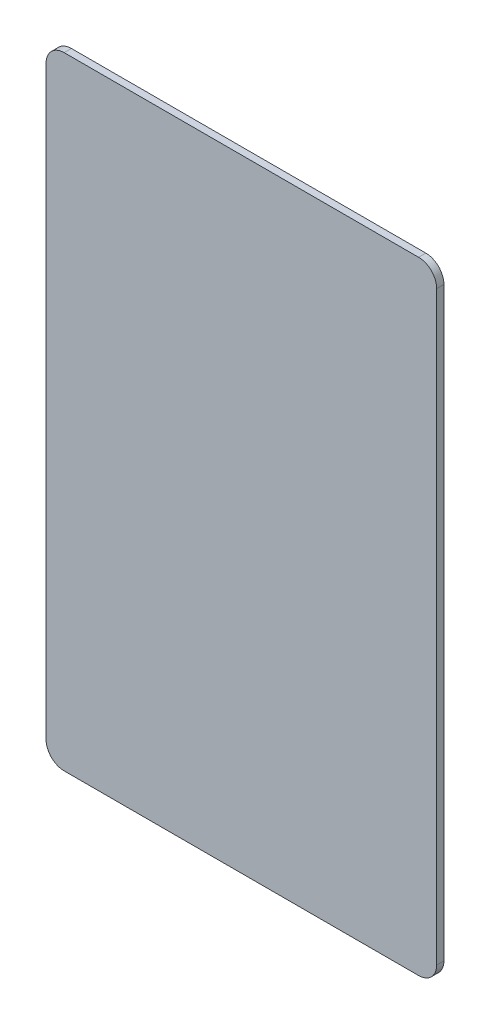
ISO-10303-21;
HEADER;
FILE_DESCRIPTION(('STEP AP214'),'2;1');
FILE_NAME('part.step','',(''),(''),'','','');
FILE_SCHEMA(('AUTOMOTIVE_DESIGN { 1 0 10303 214 1 1 1 1 }'));
ENDSEC;
DATA;
#1=APPLICATION_CONTEXT('core data for automotive mechanical design processes');
#2=APPLICATION_PROTOCOL_DEFINITION('international standard','automotive_design',2000,#1);
#3=PRODUCT_CONTEXT('',#1,'mechanical');
#4=PRODUCT('Part','Part','',(#3));
#5=PRODUCT_RELATED_PRODUCT_CATEGORY('part','',(#4));
#6=PRODUCT_DEFINITION_FORMATION('','',#4);
#7=PRODUCT_DEFINITION_CONTEXT('part definition',#1,'design');
#8=PRODUCT_DEFINITION('design','',#6,#7);
#9=PRODUCT_DEFINITION_SHAPE('','',#8);
#10=(LENGTH_UNIT() NAMED_UNIT(*) SI_UNIT(.MILLI.,.METRE.));
#11=(NAMED_UNIT(*) PLANE_ANGLE_UNIT() SI_UNIT($,.RADIAN.));
#12=(NAMED_UNIT(*) SI_UNIT($,.STERADIAN.) SOLID_ANGLE_UNIT());
#13=UNCERTAINTY_MEASURE_WITH_UNIT(LENGTH_MEASURE(1.E-05),#10,'distance_accuracy_value','');
#14=(GEOMETRIC_REPRESENTATION_CONTEXT(3) GLOBAL_UNCERTAINTY_ASSIGNED_CONTEXT((#13)) GLOBAL_UNIT_ASSIGNED_CONTEXT((#10,
#11,#12)) REPRESENTATION_CONTEXT('',''));
#15=CARTESIAN_POINT('',(0.,0.,0.));
#16=DIRECTION('',(0.,0.,1.));
#17=DIRECTION('',(1.,0.,0.));
#18=AXIS2_PLACEMENT_3D('',#15,#16,#17);
#19=CARTESIAN_POINT('',(24.5,40.5,1.));
#20=DIRECTION('',(0.,0.,-1.));
#21=DIRECTION('',(-1.,0.,0.));
#22=AXIS2_PLACEMENT_3D('',#19,#20,#21);
#23=CYLINDRICAL_SURFACE('',#22,2.5);
#24=CARTESIAN_POINT('',(24.5,40.5,0.));
#25=DIRECTION('',(0.,0.,1.));
#26=DIRECTION('',(-1.,0.,0.));
#27=AXIS2_PLACEMENT_3D('',#24,#25,#26);
#28=CIRCLE('',#27,2.5);
#29=CARTESIAN_POINT('',(27.,40.5,0.));
#30=VERTEX_POINT('',#29);
#31=CARTESIAN_POINT('',(24.5,43.,0.));
#32=VERTEX_POINT('',#31);
#33=EDGE_CURVE('E129',#30,#32,#28,.T.);
#34=ORIENTED_EDGE('',*,*,#33,.T.);
#35=DIRECTION('',(0.,0.,-1.));
#36=VECTOR('',#35,1.);
#37=CARTESIAN_POINT('',(24.5,43.,1.));
#38=LINE('',#37,#36);
#39=CARTESIAN_POINT('',(24.5,43.,1.));
#40=VERTEX_POINT('',#39);
#41=EDGE_CURVE('E11',#40,#32,#38,.T.);
#42=ORIENTED_EDGE('',*,*,#41,.F.);
#43=CARTESIAN_POINT('',(24.5,40.5,1.));
#44=DIRECTION('',(0.,0.,1.));
#45=DIRECTION('',(-1.,0.,0.));
#46=AXIS2_PLACEMENT_3D('',#43,#44,#45);
#47=CIRCLE('',#46,2.5);
#48=CARTESIAN_POINT('',(27.,40.5,1.));
#49=VERTEX_POINT('',#48);
#50=EDGE_CURVE('E143',#49,#40,#47,.T.);
#51=ORIENTED_EDGE('',*,*,#50,.F.);
#52=DIRECTION('',(0.,0.,-1.));
#53=VECTOR('',#52,1.);
#54=CARTESIAN_POINT('',(27.,40.5,1.));
#55=LINE('',#54,#53);
#56=EDGE_CURVE('E125',#49,#30,#55,.T.);
#57=ORIENTED_EDGE('',*,*,#56,.T.);
#58=EDGE_LOOP('',(#34,#42,#51,#57));
#59=FACE_BOUND('',#58,.T.);
#60=ADVANCED_FACE('F33',(#59),#23,.T.);
#61=CARTESIAN_POINT('',(-24.5,43.,1.));
#62=DIRECTION('',(0.,-1.,0.));
#63=DIRECTION('',(0.,0.,-1.));
#64=AXIS2_PLACEMENT_3D('',#61,#62,#63);
#65=PLANE('',#64);
#66=DIRECTION('',(-1.,0.,0.));
#67=VECTOR('',#66,1.);
#68=CARTESIAN_POINT('',(-24.5,43.,0.));
#69=LINE('',#68,#67);
#70=CARTESIAN_POINT('',(-24.5,43.,0.));
#71=VERTEX_POINT('',#70);
#72=EDGE_CURVE('E132',#32,#71,#69,.T.);
#73=ORIENTED_EDGE('',*,*,#72,.T.);
#74=DIRECTION('',(0.,0.,-1.));
#75=VECTOR('',#74,1.);
#76=CARTESIAN_POINT('',(-24.5,43.,1.));
#77=LINE('',#76,#75);
#78=CARTESIAN_POINT('',(-24.5,43.,1.));
#79=VERTEX_POINT('',#78);
#80=EDGE_CURVE('E41',#79,#71,#77,.T.);
#81=ORIENTED_EDGE('',*,*,#80,.F.);
#82=DIRECTION('',(-1.,0.,0.));
#83=VECTOR('',#82,1.);
#84=CARTESIAN_POINT('',(-24.5,43.,1.));
#85=LINE('',#84,#83);
#86=EDGE_CURVE('E92',#40,#79,#85,.T.);
#87=ORIENTED_EDGE('',*,*,#86,.F.);
#88=ORIENTED_EDGE('',*,*,#41,.T.);
#89=EDGE_LOOP('',(#73,#81,#87,#88));
#90=FACE_BOUND('',#89,.T.);
#91=ADVANCED_FACE('F178',(#90),#65,.F.);
#92=CARTESIAN_POINT('',(-24.5,40.5,1.));
#93=DIRECTION('',(0.,0.,-1.));
#94=DIRECTION('',(-1.,0.,0.));
#95=AXIS2_PLACEMENT_3D('',#92,#93,#94);
#96=CYLINDRICAL_SURFACE('',#95,2.5);
#97=CARTESIAN_POINT('',(-24.5,40.5,0.));
#98=DIRECTION('',(0.,0.,1.));
#99=DIRECTION('',(1.,0.,0.));
#100=AXIS2_PLACEMENT_3D('',#97,#98,#99);
#101=CIRCLE('',#100,2.5);
#102=CARTESIAN_POINT('',(-27.,40.5,0.));
#103=VERTEX_POINT('',#102);
#104=EDGE_CURVE('E134',#71,#103,#101,.T.);
#105=ORIENTED_EDGE('',*,*,#104,.T.);
#106=DIRECTION('',(0.,0.,-1.));
#107=VECTOR('',#106,1.);
#108=CARTESIAN_POINT('',(-27.,40.5,1.));
#109=LINE('',#108,#107);
#110=CARTESIAN_POINT('',(-27.,40.5,1.));
#111=VERTEX_POINT('',#110);
#112=EDGE_CURVE('E150',#111,#103,#109,.T.);
#113=ORIENTED_EDGE('',*,*,#112,.F.);
#114=CARTESIAN_POINT('',(-24.5,40.5,1.));
#115=DIRECTION('',(0.,0.,1.));
#116=DIRECTION('',(1.,0.,0.));
#117=AXIS2_PLACEMENT_3D('',#114,#115,#116);
#118=CIRCLE('',#117,2.5);
#119=EDGE_CURVE('E158',#79,#111,#118,.T.);
#120=ORIENTED_EDGE('',*,*,#119,.F.);
#121=ORIENTED_EDGE('',*,*,#80,.T.);
#122=EDGE_LOOP('',(#105,#113,#120,#121));
#123=FACE_BOUND('',#122,.T.);
#124=ADVANCED_FACE('F156',(#123),#96,.T.);
#125=CARTESIAN_POINT('',(-27.,40.5,1.));
#126=DIRECTION('',(1.,0.,0.));
#127=DIRECTION('',(0.,1.,0.));
#128=AXIS2_PLACEMENT_3D('',#125,#126,#127);
#129=PLANE('',#128);
#130=DIRECTION('',(0.,-1.,0.));
#131=VECTOR('',#130,1.);
#132=CARTESIAN_POINT('',(-27.,40.5,0.));
#133=LINE('',#132,#131);
#134=CARTESIAN_POINT('',(-27.,-40.5,0.));
#135=VERTEX_POINT('',#134);
#136=EDGE_CURVE('E136',#103,#135,#133,.T.);
#137=ORIENTED_EDGE('',*,*,#136,.T.);
#138=DIRECTION('',(0.,0.,-1.));
#139=VECTOR('',#138,1.);
#140=CARTESIAN_POINT('',(-27.,-40.5,1.));
#141=LINE('',#140,#139);
#142=CARTESIAN_POINT('',(-27.,-40.5,1.));
#143=VERTEX_POINT('',#142);
#144=EDGE_CURVE('E147',#143,#135,#141,.T.);
#145=ORIENTED_EDGE('',*,*,#144,.F.);
#146=DIRECTION('',(0.,-1.,0.));
#147=VECTOR('',#146,1.);
#148=CARTESIAN_POINT('',(-27.,40.5,1.));
#149=LINE('',#148,#147);
#150=EDGE_CURVE('E170',#111,#143,#149,.T.);
#151=ORIENTED_EDGE('',*,*,#150,.F.);
#152=ORIENTED_EDGE('',*,*,#112,.T.);
#153=EDGE_LOOP('',(#137,#145,#151,#152));
#154=FACE_BOUND('',#153,.T.);
#155=ADVANCED_FACE('F166',(#154),#129,.F.);
#156=CARTESIAN_POINT('',(-24.5,-40.5,1.));
#157=DIRECTION('',(0.,0.,-1.));
#158=DIRECTION('',(-1.,0.,0.));
#159=AXIS2_PLACEMENT_3D('',#156,#157,#158);
#160=CYLINDRICAL_SURFACE('',#159,2.5);
#161=CARTESIAN_POINT('',(-24.5,-40.5,0.));
#162=DIRECTION('',(0.,0.,1.));
#163=DIRECTION('',(1.,0.,0.));
#164=AXIS2_PLACEMENT_3D('',#161,#162,#163);
#165=CIRCLE('',#164,2.5);
#166=CARTESIAN_POINT('',(-24.5,-43.,0.));
#167=VERTEX_POINT('',#166);
#168=EDGE_CURVE('E138',#135,#167,#165,.T.);
#169=ORIENTED_EDGE('',*,*,#168,.T.);
#170=DIRECTION('',(0.,0.,-1.));
#171=VECTOR('',#170,1.);
#172=CARTESIAN_POINT('',(-24.5,-43.,1.));
#173=LINE('',#172,#171);
#174=CARTESIAN_POINT('',(-24.5,-43.,1.));
#175=VERTEX_POINT('',#174);
#176=EDGE_CURVE('E120',#175,#167,#173,.T.);
#177=ORIENTED_EDGE('',*,*,#176,.F.);
#178=CARTESIAN_POINT('',(-24.5,-40.5,1.));
#179=DIRECTION('',(0.,0.,1.));
#180=DIRECTION('',(1.,0.,0.));
#181=AXIS2_PLACEMENT_3D('',#178,#179,#180);
#182=CIRCLE('',#181,2.5);
#183=EDGE_CURVE('E111',#143,#175,#182,.T.);
#184=ORIENTED_EDGE('',*,*,#183,.F.);
#185=ORIENTED_EDGE('',*,*,#144,.T.);
#186=EDGE_LOOP('',(#169,#177,#184,#185));
#187=FACE_BOUND('',#186,.T.);
#188=ADVANCED_FACE('F169',(#187),#160,.T.);
#189=CARTESIAN_POINT('',(-24.5,-43.,1.));
#190=DIRECTION('',(0.,1.,0.));
#191=DIRECTION('',(0.,0.,1.));
#192=AXIS2_PLACEMENT_3D('',#189,#190,#191);
#193=PLANE('',#192);
#194=DIRECTION('',(1.,0.,0.));
#195=VECTOR('',#194,1.);
#196=CARTESIAN_POINT('',(-24.5,-43.,0.));
#197=LINE('',#196,#195);
#198=CARTESIAN_POINT('',(24.5,-43.,0.));
#199=VERTEX_POINT('',#198);
#200=EDGE_CURVE('E119',#167,#199,#197,.T.);
#201=ORIENTED_EDGE('',*,*,#200,.T.);
#202=DIRECTION('',(0.,0.,-1.));
#203=VECTOR('',#202,1.);
#204=CARTESIAN_POINT('',(24.5,-43.,1.));
#205=LINE('',#204,#203);
#206=CARTESIAN_POINT('',(24.5,-43.,1.));
#207=VERTEX_POINT('',#206);
#208=EDGE_CURVE('E116',#207,#199,#205,.T.);
#209=ORIENTED_EDGE('',*,*,#208,.F.);
#210=DIRECTION('',(1.,0.,0.));
#211=VECTOR('',#210,1.);
#212=CARTESIAN_POINT('',(-24.5,-43.,1.));
#213=LINE('',#212,#211);
#214=EDGE_CURVE('E105',#175,#207,#213,.T.);
#215=ORIENTED_EDGE('',*,*,#214,.F.);
#216=ORIENTED_EDGE('',*,*,#176,.T.);
#217=EDGE_LOOP('',(#201,#209,#215,#216));
#218=FACE_BOUND('',#217,.T.);
#219=ADVANCED_FACE('F117',(#218),#193,.F.);
#220=CARTESIAN_POINT('',(24.5,-40.5,1.));
#221=DIRECTION('',(0.,0.,-1.));
#222=DIRECTION('',(-1.,0.,0.));
#223=AXIS2_PLACEMENT_3D('',#220,#221,#222);
#224=CYLINDRICAL_SURFACE('',#223,2.5);
#225=CARTESIAN_POINT('',(24.5,-40.5,0.));
#226=DIRECTION('',(0.,0.,1.));
#227=DIRECTION('',(1.,0.,0.));
#228=AXIS2_PLACEMENT_3D('',#225,#226,#227);
#229=CIRCLE('',#228,2.5);
#230=CARTESIAN_POINT('',(27.,-40.5,0.));
#231=VERTEX_POINT('',#230);
#232=EDGE_CURVE('E78',#199,#231,#229,.T.);
#233=ORIENTED_EDGE('',*,*,#232,.T.);
#234=DIRECTION('',(0.,0.,-1.));
#235=VECTOR('',#234,1.);
#236=CARTESIAN_POINT('',(27.,-40.5,1.));
#237=LINE('',#236,#235);
#238=CARTESIAN_POINT('',(27.,-40.5,1.));
#239=VERTEX_POINT('',#238);
#240=EDGE_CURVE('E121',#239,#231,#237,.T.);
#241=ORIENTED_EDGE('',*,*,#240,.F.);
#242=CARTESIAN_POINT('',(24.5,-40.5,1.));
#243=DIRECTION('',(0.,0.,1.));
#244=DIRECTION('',(1.,0.,0.));
#245=AXIS2_PLACEMENT_3D('',#242,#243,#244);
#246=CIRCLE('',#245,2.5);
#247=EDGE_CURVE('E109',#207,#239,#246,.T.);
#248=ORIENTED_EDGE('',*,*,#247,.F.);
#249=ORIENTED_EDGE('',*,*,#208,.T.);
#250=EDGE_LOOP('',(#233,#241,#248,#249));
#251=FACE_BOUND('',#250,.T.);
#252=ADVANCED_FACE('F123',(#251),#224,.T.);
#253=CARTESIAN_POINT('',(27.,40.5,1.));
#254=DIRECTION('',(-1.,0.,0.));
#255=DIRECTION('',(0.,-1.,0.));
#256=AXIS2_PLACEMENT_3D('',#253,#254,#255);
#257=PLANE('',#256);
#258=DIRECTION('',(0.,1.,0.));
#259=VECTOR('',#258,1.);
#260=CARTESIAN_POINT('',(27.,40.5,0.));
#261=LINE('',#260,#259);
#262=EDGE_CURVE('E84',#231,#30,#261,.T.);
#263=ORIENTED_EDGE('',*,*,#262,.T.);
#264=ORIENTED_EDGE('',*,*,#56,.F.);
#265=DIRECTION('',(0.,1.,0.));
#266=VECTOR('',#265,1.);
#267=CARTESIAN_POINT('',(27.,40.5,1.));
#268=LINE('',#267,#266);
#269=EDGE_CURVE('E49',#239,#49,#268,.T.);
#270=ORIENTED_EDGE('',*,*,#269,.F.);
#271=ORIENTED_EDGE('',*,*,#240,.T.);
#272=EDGE_LOOP('',(#263,#264,#270,#271));
#273=FACE_BOUND('',#272,.T.);
#274=ADVANCED_FACE('F194',(#273),#257,.F.);
#275=CARTESIAN_POINT('',(24.5,40.5,1.));
#276=DIRECTION('',(0.,0.,-1.));
#277=DIRECTION('',(-1.,0.,0.));
#278=AXIS2_PLACEMENT_3D('',#275,#276,#277);
#279=PLANE('',#278);
#280=ORIENTED_EDGE('',*,*,#50,.T.);
#281=ORIENTED_EDGE('',*,*,#86,.T.);
#282=ORIENTED_EDGE('',*,*,#119,.T.);
#283=ORIENTED_EDGE('',*,*,#150,.T.);
#284=ORIENTED_EDGE('',*,*,#183,.T.);
#285=ORIENTED_EDGE('',*,*,#214,.T.);
#286=ORIENTED_EDGE('',*,*,#247,.T.);
#287=ORIENTED_EDGE('',*,*,#269,.T.);
#288=EDGE_LOOP('',(#280,#281,#282,#283,#284,#285,#286,#287));
#289=FACE_BOUND('',#288,.T.);
#290=ADVANCED_FACE('F107',(#289),#279,.F.);
#291=CARTESIAN_POINT('',(24.5,40.5,0.));
#292=DIRECTION('',(0.,0.,-1.));
#293=DIRECTION('',(-1.,0.,0.));
#294=AXIS2_PLACEMENT_3D('',#291,#292,#293);
#295=PLANE('',#294);
#296=ORIENTED_EDGE('',*,*,#33,.F.);
#297=ORIENTED_EDGE('',*,*,#262,.F.);
#298=ORIENTED_EDGE('',*,*,#232,.F.);
#299=ORIENTED_EDGE('',*,*,#200,.F.);
#300=ORIENTED_EDGE('',*,*,#168,.F.);
#301=ORIENTED_EDGE('',*,*,#136,.F.);
#302=ORIENTED_EDGE('',*,*,#104,.F.);
#303=ORIENTED_EDGE('',*,*,#72,.F.);
#304=EDGE_LOOP('',(#296,#297,#298,#299,#300,#301,#302,#303));
#305=FACE_BOUND('',#304,.T.);
#306=ADVANCED_FACE('F162',(#305),#295,.T.);
#307=CLOSED_SHELL('',(#60,#91,#124,#155,#188,#219,#252,#274,#290,#306));
#308=MANIFOLD_SOLID_BREP('B2',#307);
#309=ADVANCED_BREP_SHAPE_REPRESENTATION('',(#18,#308),#14);
#310=SHAPE_DEFINITION_REPRESENTATION(#9,#309);
ENDSEC;
END-ISO-10303-21;
